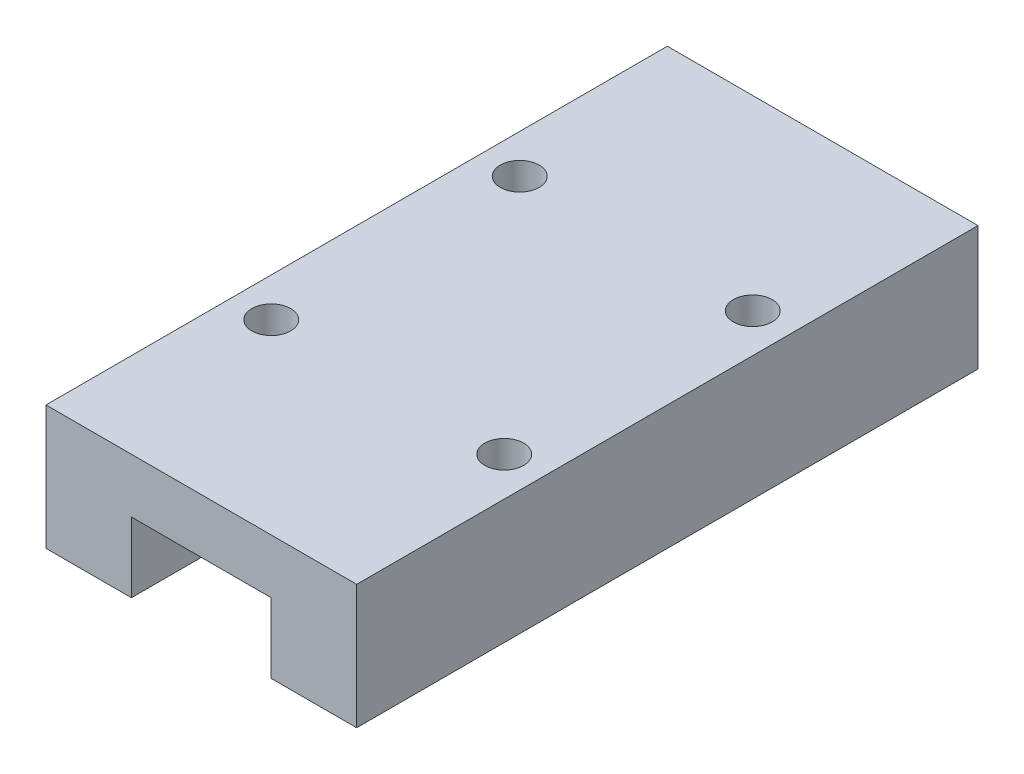
ISO-10303-21;
HEADER;
FILE_DESCRIPTION(('STEP AP214'),'2;1');
FILE_NAME('part.step','',(''),(''),'','','');
FILE_SCHEMA(('AUTOMOTIVE_DESIGN { 1 0 10303 214 1 1 1 1 }'));
ENDSEC;
DATA;
#1=APPLICATION_CONTEXT('core data for automotive mechanical design processes');
#2=APPLICATION_PROTOCOL_DEFINITION('international standard','automotive_design',2000,#1);
#3=PRODUCT_CONTEXT('',#1,'mechanical');
#4=PRODUCT('Part','Part','',(#3));
#5=PRODUCT_RELATED_PRODUCT_CATEGORY('part','',(#4));
#6=PRODUCT_DEFINITION_FORMATION('','',#4);
#7=PRODUCT_DEFINITION_CONTEXT('part definition',#1,'design');
#8=PRODUCT_DEFINITION('design','',#6,#7);
#9=PRODUCT_DEFINITION_SHAPE('','',#8);
#10=(LENGTH_UNIT() NAMED_UNIT(*) SI_UNIT(.MILLI.,.METRE.));
#11=(NAMED_UNIT(*) PLANE_ANGLE_UNIT() SI_UNIT($,.RADIAN.));
#12=(NAMED_UNIT(*) SI_UNIT($,.STERADIAN.) SOLID_ANGLE_UNIT());
#13=UNCERTAINTY_MEASURE_WITH_UNIT(LENGTH_MEASURE(1.E-05),#10,'distance_accuracy_value','');
#14=(GEOMETRIC_REPRESENTATION_CONTEXT(3) GLOBAL_UNCERTAINTY_ASSIGNED_CONTEXT((#13)) GLOBAL_UNIT_ASSIGNED_CONTEXT((#10,
#11,#12)) REPRESENTATION_CONTEXT('',''));
#15=CARTESIAN_POINT('',(0.,0.,0.));
#16=DIRECTION('',(0.,0.,1.));
#17=DIRECTION('',(1.,0.,0.));
#18=AXIS2_PLACEMENT_3D('',#15,#16,#17);
#19=CARTESIAN_POINT('',(5.49999999999995,0.,40.));
#20=DIRECTION('',(0.,1.00000000000001,0.));
#21=DIRECTION('',(-0.999999999999994,0.,0.));
#22=AXIS2_PLACEMENT_3D('',#19,#20,#21);
#23=PLANE('',#22);
#24=DIRECTION('',(0.999999999999994,0.,0.));
#25=VECTOR('',#24,1.);
#26=CARTESIAN_POINT('',(5.49999999999995,0.,0.));
#27=LINE('',#26,#25);
#28=CARTESIAN_POINT('',(0.,0.,0.));
#29=VERTEX_POINT('',#28);
#30=CARTESIAN_POINT('',(5.49999999999995,0.,0.));
#31=VERTEX_POINT('',#30);
#32=EDGE_CURVE('E137',#29,#31,#27,.T.);
#33=ORIENTED_EDGE('',*,*,#32,.T.);
#34=DIRECTION('',(0.,0.,-1.));
#35=VECTOR('',#34,1.);
#36=CARTESIAN_POINT('',(5.49999999999995,0.,40.));
#37=LINE('',#36,#35);
#38=CARTESIAN_POINT('',(5.49999999999995,0.,40.));
#39=VERTEX_POINT('',#38);
#40=EDGE_CURVE('E11',#39,#31,#37,.T.);
#41=ORIENTED_EDGE('',*,*,#40,.F.);
#42=DIRECTION('',(0.999999999999994,0.,0.));
#43=VECTOR('',#42,1.);
#44=CARTESIAN_POINT('',(5.49999999999995,0.,40.));
#45=LINE('',#44,#43);
#46=CARTESIAN_POINT('',(0.,0.,39.9999999999999));
#47=VERTEX_POINT('',#46);
#48=EDGE_CURVE('E152',#47,#39,#45,.T.);
#49=ORIENTED_EDGE('',*,*,#48,.F.);
#50=DIRECTION('',(0.,0.,-1.));
#51=VECTOR('',#50,1.);
#52=CARTESIAN_POINT('',(0.,0.,39.9999999999999));
#53=LINE('',#52,#51);
#54=EDGE_CURVE('E133',#47,#29,#53,.T.);
#55=ORIENTED_EDGE('',*,*,#54,.T.);
#56=EDGE_LOOP('',(#33,#41,#49,#55));
#57=FACE_BOUND('',#56,.T.);
#58=ADVANCED_FACE('F38',(#57),#23,.F.);
#59=CARTESIAN_POINT('',(5.49999999999995,4.50000000000005,40.));
#60=DIRECTION('',(-0.999999999999994,0.,0.));
#61=DIRECTION('',(0.,-1.00000000000001,0.));
#62=AXIS2_PLACEMENT_3D('',#59,#60,#61);
#63=PLANE('',#62);
#64=DIRECTION('',(0.,1.00000000000001,0.));
#65=VECTOR('',#64,1.);
#66=CARTESIAN_POINT('',(5.49999999999995,4.50000000000005,0.));
#67=LINE('',#66,#65);
#68=CARTESIAN_POINT('',(5.49999999999995,4.50000000000005,0.));
#69=VERTEX_POINT('',#68);
#70=EDGE_CURVE('E140',#31,#69,#67,.T.);
#71=ORIENTED_EDGE('',*,*,#70,.T.);
#72=DIRECTION('',(0.,0.,-1.));
#73=VECTOR('',#72,1.);
#74=CARTESIAN_POINT('',(5.49999999999995,4.50000000000005,40.));
#75=LINE('',#74,#73);
#76=CARTESIAN_POINT('',(5.49999999999995,4.50000000000005,40.));
#77=VERTEX_POINT('',#76);
#78=EDGE_CURVE('E46',#77,#69,#75,.T.);
#79=ORIENTED_EDGE('',*,*,#78,.F.);
#80=DIRECTION('',(0.,1.00000000000001,0.));
#81=VECTOR('',#80,1.);
#82=CARTESIAN_POINT('',(5.49999999999995,4.50000000000005,40.));
#83=LINE('',#82,#81);
#84=EDGE_CURVE('E98',#39,#77,#83,.T.);
#85=ORIENTED_EDGE('',*,*,#84,.F.);
#86=ORIENTED_EDGE('',*,*,#40,.T.);
#87=EDGE_LOOP('',(#71,#79,#85,#86));
#88=FACE_BOUND('',#87,.T.);
#89=ADVANCED_FACE('F238',(#88),#63,.F.);
#90=CARTESIAN_POINT('',(14.4999999999999,4.50000000000005,39.9999999999996));
#91=DIRECTION('',(0.,1.00000000000001,0.));
#92=DIRECTION('',(-0.999999999999995,0.,0.));
#93=AXIS2_PLACEMENT_3D('',#90,#91,#92);
#94=PLANE('',#93);
#95=DIRECTION('',(0.999999999999995,0.,0.));
#96=VECTOR('',#95,1.);
#97=CARTESIAN_POINT('',(14.4999999999999,4.50000000000003,-6.38378239159465E-13));
#98=LINE('',#97,#96);
#99=CARTESIAN_POINT('',(14.4999999999999,4.50000000000003,-6.38378239159465E-13));
#100=VERTEX_POINT('',#99);
#101=EDGE_CURVE('E143',#69,#100,#98,.T.);
#102=ORIENTED_EDGE('',*,*,#101,.T.);
#103=DIRECTION('',(0.,0.,-1.));
#104=VECTOR('',#103,1.);
#105=CARTESIAN_POINT('',(14.4999999999999,4.50000000000005,39.9999999999996));
#106=LINE('',#105,#104);
#107=CARTESIAN_POINT('',(14.4999999999999,4.50000000000005,39.9999999999996));
#108=VERTEX_POINT('',#107);
#109=EDGE_CURVE('E159',#108,#100,#106,.T.);
#110=ORIENTED_EDGE('',*,*,#109,.F.);
#111=DIRECTION('',(0.999999999999995,0.,0.));
#112=VECTOR('',#111,1.);
#113=CARTESIAN_POINT('',(14.4999999999999,4.50000000000005,39.9999999999996));
#114=LINE('',#113,#112);
#115=EDGE_CURVE('E167',#77,#108,#114,.T.);
#116=ORIENTED_EDGE('',*,*,#115,.F.);
#117=ORIENTED_EDGE('',*,*,#78,.T.);
#118=EDGE_LOOP('',(#102,#110,#116,#117));
#119=FACE_BOUND('',#118,.T.);
#120=ADVANCED_FACE('F165',(#119),#94,.F.);
#121=CARTESIAN_POINT('',(14.4999999999999,0.,39.9999999999996));
#122=DIRECTION('',(0.999999999999994,0.,0.));
#123=DIRECTION('',(0.,0.,-1.));
#124=AXIS2_PLACEMENT_3D('',#121,#122,#123);
#125=PLANE('',#124);
#126=DIRECTION('',(0.,-1.00000000000001,0.));
#127=VECTOR('',#126,1.);
#128=CARTESIAN_POINT('',(14.4999999999999,0.,-6.38378239159465E-13));
#129=LINE('',#128,#127);
#130=CARTESIAN_POINT('',(14.4999999999999,0.,-6.38378239159465E-13));
#131=VERTEX_POINT('',#130);
#132=EDGE_CURVE('E145',#100,#131,#129,.T.);
#133=ORIENTED_EDGE('',*,*,#132,.T.);
#134=DIRECTION('',(0.,0.,-1.));
#135=VECTOR('',#134,1.);
#136=CARTESIAN_POINT('',(14.4999999999999,0.,39.9999999999996));
#137=LINE('',#136,#135);
#138=CARTESIAN_POINT('',(14.4999999999999,0.,39.9999999999996));
#139=VERTEX_POINT('',#138);
#140=EDGE_CURVE('E156',#139,#131,#137,.T.);
#141=ORIENTED_EDGE('',*,*,#140,.F.);
#142=DIRECTION('',(0.,-1.00000000000001,0.));
#143=VECTOR('',#142,1.);
#144=CARTESIAN_POINT('',(14.4999999999999,0.,39.9999999999996));
#145=LINE('',#144,#143);
#146=EDGE_CURVE('E179',#108,#139,#145,.T.);
#147=ORIENTED_EDGE('',*,*,#146,.F.);
#148=ORIENTED_EDGE('',*,*,#109,.T.);
#149=EDGE_LOOP('',(#133,#141,#147,#148));
#150=FACE_BOUND('',#149,.T.);
#151=ADVANCED_FACE('F175',(#150),#125,.F.);
#152=CARTESIAN_POINT('',(19.9999999999998,0.,39.9999999999999));
#153=DIRECTION('',(0.,1.00000000000001,0.));
#154=DIRECTION('',(-0.999999999999994,0.,0.));
#155=AXIS2_PLACEMENT_3D('',#152,#153,#154);
#156=PLANE('',#155);
#157=DIRECTION('',(0.999999999999994,0.,0.));
#158=VECTOR('',#157,1.);
#159=CARTESIAN_POINT('',(19.9999999999998,0.,-1.11022302462516E-13));
#160=LINE('',#159,#158);
#161=CARTESIAN_POINT('',(19.9999999999998,0.,-1.11022302462516E-13));
#162=VERTEX_POINT('',#161);
#163=EDGE_CURVE('E147',#131,#162,#160,.T.);
#164=ORIENTED_EDGE('',*,*,#163,.T.);
#165=DIRECTION('',(0.,0.,-1.));
#166=VECTOR('',#165,1.);
#167=CARTESIAN_POINT('',(19.9999999999998,0.,39.9999999999999));
#168=LINE('',#167,#166);
#169=CARTESIAN_POINT('',(19.9999999999998,0.,39.9999999999999));
#170=VERTEX_POINT('',#169);
#171=EDGE_CURVE('E128',#170,#162,#168,.T.);
#172=ORIENTED_EDGE('',*,*,#171,.F.);
#173=DIRECTION('',(0.999999999999994,0.,0.));
#174=VECTOR('',#173,1.);
#175=CARTESIAN_POINT('',(19.9999999999998,0.,39.9999999999999));
#176=LINE('',#175,#174);
#177=EDGE_CURVE('E119',#139,#170,#176,.T.);
#178=ORIENTED_EDGE('',*,*,#177,.F.);
#179=ORIENTED_EDGE('',*,*,#140,.T.);
#180=EDGE_LOOP('',(#164,#172,#178,#179));
#181=FACE_BOUND('',#180,.T.);
#182=ADVANCED_FACE('F178',(#181),#156,.F.);
#183=CARTESIAN_POINT('',(19.9999999999998,8.00000000000009,39.9999999999999));
#184=DIRECTION('',(-0.999999999999994,0.,0.));
#185=DIRECTION('',(0.,-1.00000000000001,0.));
#186=AXIS2_PLACEMENT_3D('',#183,#184,#185);
#187=PLANE('',#186);
#188=DIRECTION('',(0.,1.00000000000001,0.));
#189=VECTOR('',#188,1.);
#190=CARTESIAN_POINT('',(19.9999999999998,8.00000000000009,-1.11022302462516E-13));
#191=LINE('',#190,#189);
#192=CARTESIAN_POINT('',(19.9999999999998,8.00000000000009,-1.11022302462516E-13));
#193=VERTEX_POINT('',#192);
#194=EDGE_CURVE('E127',#162,#193,#191,.T.);
#195=ORIENTED_EDGE('',*,*,#194,.T.);
#196=DIRECTION('',(0.,0.,-1.));
#197=VECTOR('',#196,1.);
#198=CARTESIAN_POINT('',(19.9999999999998,8.00000000000009,39.9999999999999));
#199=LINE('',#198,#197);
#200=CARTESIAN_POINT('',(19.9999999999998,8.00000000000009,39.9999999999999));
#201=VERTEX_POINT('',#200);
#202=EDGE_CURVE('E124',#201,#193,#199,.T.);
#203=ORIENTED_EDGE('',*,*,#202,.F.);
#204=DIRECTION('',(0.,1.00000000000001,0.));
#205=VECTOR('',#204,1.);
#206=CARTESIAN_POINT('',(19.9999999999998,8.00000000000009,39.9999999999999));
#207=LINE('',#206,#205);
#208=EDGE_CURVE('E113',#170,#201,#207,.T.);
#209=ORIENTED_EDGE('',*,*,#208,.F.);
#210=ORIENTED_EDGE('',*,*,#171,.T.);
#211=EDGE_LOOP('',(#195,#203,#209,#210));
#212=FACE_BOUND('',#211,.T.);
#213=ADVANCED_FACE('F125',(#212),#187,.F.);
#214=CARTESIAN_POINT('',(0.,8.00000000000008,39.9999999999999));
#215=DIRECTION('',(0.,-1.00000000000001,0.));
#216=DIRECTION('',(0.999999999999994,0.,0.));
#217=AXIS2_PLACEMENT_3D('',#214,#215,#216);
#218=PLANE('',#217);
#219=CARTESIAN_POINT('',(2.49999999999997,8.00000000000009,12.));
#220=DIRECTION('',(0.,1.00000000000001,0.));
#221=DIRECTION('',(0.,0.,1.));
#222=AXIS2_PLACEMENT_3D('',#219,#220,#221);
#223=CIRCLE('',#222,1.24999999999999);
#224=CARTESIAN_POINT('',(2.49999999999997,8.00000000000009,13.2499999999999));
#225=VERTEX_POINT('',#224);
#226=EDGE_CURVE('E205',#225,#225,#223,.T.);
#227=ORIENTED_EDGE('',*,*,#226,.F.);
#228=EDGE_LOOP('',(#227));
#229=FACE_BOUND('',#228,.T.);
#230=CARTESIAN_POINT('',(17.4999999999998,8.00000000000009,27.9999999999999));
#231=DIRECTION('',(0.,1.00000000000001,0.));
#232=DIRECTION('',(0.,0.,1.));
#233=AXIS2_PLACEMENT_3D('',#230,#231,#232);
#234=CIRCLE('',#233,1.24999999999999);
#235=CARTESIAN_POINT('',(17.4999999999998,8.00000000000009,29.2499999999998));
#236=VERTEX_POINT('',#235);
#237=EDGE_CURVE('E199',#236,#236,#234,.T.);
#238=ORIENTED_EDGE('',*,*,#237,.F.);
#239=EDGE_LOOP('',(#238));
#240=FACE_BOUND('',#239,.T.);
#241=CARTESIAN_POINT('',(17.4999999999998,8.0000000000001,11.9999999999998));
#242=DIRECTION('',(0.,1.00000000000001,0.));
#243=DIRECTION('',(0.,0.,1.));
#244=AXIS2_PLACEMENT_3D('',#241,#242,#243);
#245=CIRCLE('',#244,1.24999999999999);
#246=CARTESIAN_POINT('',(17.4999999999998,8.0000000000001,13.2499999999998));
#247=VERTEX_POINT('',#246);
#248=EDGE_CURVE('E193',#247,#247,#245,.T.);
#249=ORIENTED_EDGE('',*,*,#248,.F.);
#250=EDGE_LOOP('',(#249));
#251=FACE_BOUND('',#250,.T.);
#252=CARTESIAN_POINT('',(2.49999999999997,8.00000000000006,28.));
#253=DIRECTION('',(0.,1.00000000000001,0.));
#254=DIRECTION('',(0.,0.,1.));
#255=AXIS2_PLACEMENT_3D('',#252,#253,#254);
#256=CIRCLE('',#255,1.24999999999999);
#257=CARTESIAN_POINT('',(2.49999999999997,8.00000000000006,29.25));
#258=VERTEX_POINT('',#257);
#259=EDGE_CURVE('E187',#258,#258,#256,.T.);
#260=ORIENTED_EDGE('',*,*,#259,.F.);
#261=EDGE_LOOP('',(#260));
#262=FACE_BOUND('',#261,.T.);
#263=DIRECTION('',(-0.999999999999994,0.,0.));
#264=VECTOR('',#263,1.);
#265=CARTESIAN_POINT('',(0.,8.00000000000009,0.));
#266=LINE('',#265,#264);
#267=CARTESIAN_POINT('',(0.,8.00000000000009,0.));
#268=VERTEX_POINT('',#267);
#269=EDGE_CURVE('E84',#193,#268,#266,.T.);
#270=ORIENTED_EDGE('',*,*,#269,.T.);
#271=DIRECTION('',(0.,0.,-1.));
#272=VECTOR('',#271,1.);
#273=CARTESIAN_POINT('',(0.,8.00000000000008,39.9999999999999));
#274=LINE('',#273,#272);
#275=CARTESIAN_POINT('',(0.,8.00000000000008,39.9999999999999));
#276=VERTEX_POINT('',#275);
#277=EDGE_CURVE('E129',#276,#268,#274,.T.);
#278=ORIENTED_EDGE('',*,*,#277,.F.);
#279=DIRECTION('',(-0.999999999999994,0.,0.));
#280=VECTOR('',#279,1.);
#281=CARTESIAN_POINT('',(0.,8.00000000000008,39.9999999999999));
#282=LINE('',#281,#280);
#283=EDGE_CURVE('E117',#201,#276,#282,.T.);
#284=ORIENTED_EDGE('',*,*,#283,.F.);
#285=ORIENTED_EDGE('',*,*,#202,.T.);
#286=EDGE_LOOP('',(#270,#278,#284,#285));
#287=FACE_BOUND('',#286,.T.);
#288=ADVANCED_FACE('F131',(#229,#240,#251,#262,#287),#218,.F.);
#289=CARTESIAN_POINT('',(0.,0.,39.9999999999999));
#290=DIRECTION('',(0.999999999999994,0.,0.));
#291=DIRECTION('',(0.,0.,-1.));
#292=AXIS2_PLACEMENT_3D('',#289,#290,#291);
#293=PLANE('',#292);
#294=DIRECTION('',(0.,-1.00000000000001,0.));
#295=VECTOR('',#294,1.);
#296=CARTESIAN_POINT('',(0.,0.,0.));
#297=LINE('',#296,#295);
#298=EDGE_CURVE('E90',#268,#29,#297,.T.);
#299=ORIENTED_EDGE('',*,*,#298,.T.);
#300=ORIENTED_EDGE('',*,*,#54,.F.);
#301=DIRECTION('',(0.,-1.00000000000001,0.));
#302=VECTOR('',#301,1.);
#303=CARTESIAN_POINT('',(0.,0.,39.9999999999999));
#304=LINE('',#303,#302);
#305=EDGE_CURVE('E54',#276,#47,#304,.T.);
#306=ORIENTED_EDGE('',*,*,#305,.F.);
#307=ORIENTED_EDGE('',*,*,#277,.T.);
#308=EDGE_LOOP('',(#299,#300,#306,#307));
#309=FACE_BOUND('',#308,.T.);
#310=ADVANCED_FACE('F213',(#309),#293,.F.);
#311=CARTESIAN_POINT('',(0.,0.,39.9999999999999));
#312=DIRECTION('',(0.,0.,-1.));
#313=DIRECTION('',(-0.999999999999994,0.,0.));
#314=AXIS2_PLACEMENT_3D('',#311,#312,#313);
#315=PLANE('',#314);
#316=ORIENTED_EDGE('',*,*,#48,.T.);
#317=ORIENTED_EDGE('',*,*,#84,.T.);
#318=ORIENTED_EDGE('',*,*,#115,.T.);
#319=ORIENTED_EDGE('',*,*,#146,.T.);
#320=ORIENTED_EDGE('',*,*,#177,.T.);
#321=ORIENTED_EDGE('',*,*,#208,.T.);
#322=ORIENTED_EDGE('',*,*,#283,.T.);
#323=ORIENTED_EDGE('',*,*,#305,.T.);
#324=EDGE_LOOP('',(#316,#317,#318,#319,#320,#321,#322,#323));
#325=FACE_BOUND('',#324,.T.);
#326=ADVANCED_FACE('F115',(#325),#315,.F.);
#327=CARTESIAN_POINT('',(0.,0.,0.));
#328=DIRECTION('',(0.,0.,-1.));
#329=DIRECTION('',(-0.999999999999994,0.,0.));
#330=AXIS2_PLACEMENT_3D('',#327,#328,#329);
#331=PLANE('',#330);
#332=ORIENTED_EDGE('',*,*,#32,.F.);
#333=ORIENTED_EDGE('',*,*,#298,.F.);
#334=ORIENTED_EDGE('',*,*,#269,.F.);
#335=ORIENTED_EDGE('',*,*,#194,.F.);
#336=ORIENTED_EDGE('',*,*,#163,.F.);
#337=ORIENTED_EDGE('',*,*,#132,.F.);
#338=ORIENTED_EDGE('',*,*,#101,.F.);
#339=ORIENTED_EDGE('',*,*,#70,.F.);
#340=EDGE_LOOP('',(#332,#333,#334,#335,#336,#337,#338,#339));
#341=FACE_BOUND('',#340,.T.);
#342=ADVANCED_FACE('F171',(#341),#331,.T.);
#343=CARTESIAN_POINT('',(2.49999999999998,2.00000000000001,28.));
#344=DIRECTION('',(0.,1.00000000000001,0.));
#345=DIRECTION('',(0.,0.,1.));
#346=AXIS2_PLACEMENT_3D('',#343,#344,#345);
#347=CONICAL_SURFACE('',#346,1.25,1.02974425867665);
#348=CARTESIAN_POINT('',(2.49999999999997,1.24892422621556,28.));
#349=VERTEX_POINT('',#348);
#350=VERTEX_LOOP('',#349);
#351=FACE_BOUND('',#350,.T.);
#352=CARTESIAN_POINT('',(2.49999999999998,2.00000000000001,28.));
#353=DIRECTION('',(0.,1.00000000000001,0.));
#354=DIRECTION('',(0.,0.,1.));
#355=AXIS2_PLACEMENT_3D('',#352,#353,#354);
#356=CIRCLE('',#355,1.25);
#357=CARTESIAN_POINT('',(2.49999999999998,2.00000000000001,29.25));
#358=VERTEX_POINT('',#357);
#359=EDGE_CURVE('E141',#358,#358,#356,.T.);
#360=ORIENTED_EDGE('',*,*,#359,.T.);
#361=EDGE_LOOP('',(#360));
#362=FACE_BOUND('',#361,.T.);
#363=ADVANCED_FACE('F224',(#351,#362),#347,.F.);
#364=CARTESIAN_POINT('',(2.49999999999997,8.00000000000006,28.));
#365=DIRECTION('',(0.,1.00000000000001,0.));
#366=DIRECTION('',(0.,0.,1.));
#367=AXIS2_PLACEMENT_3D('',#364,#365,#366);
#368=CYLINDRICAL_SURFACE('',#367,1.24999999999999);
#369=ORIENTED_EDGE('',*,*,#359,.F.);
#370=EDGE_LOOP('',(#369));
#371=FACE_BOUND('',#370,.T.);
#372=ORIENTED_EDGE('',*,*,#259,.T.);
#373=EDGE_LOOP('',(#372));
#374=FACE_BOUND('',#373,.T.);
#375=ADVANCED_FACE('F221',(#371,#374),#368,.F.);
#376=CARTESIAN_POINT('',(17.4999999999998,2.00000000000002,11.9999999999999));
#377=DIRECTION('',(0.,1.00000000000001,0.));
#378=DIRECTION('',(0.,0.,1.));
#379=AXIS2_PLACEMENT_3D('',#376,#377,#378);
#380=CONICAL_SURFACE('',#379,1.25,1.02974425867665);
#381=CARTESIAN_POINT('',(17.4999999999998,1.24892422621556,11.9999999999999));
#382=VERTEX_POINT('',#381);
#383=VERTEX_LOOP('',#382);
#384=FACE_BOUND('',#383,.T.);
#385=CARTESIAN_POINT('',(17.4999999999998,2.00000000000002,11.9999999999999));
#386=DIRECTION('',(0.,1.00000000000001,0.));
#387=DIRECTION('',(0.,0.,1.));
#388=AXIS2_PLACEMENT_3D('',#385,#386,#387);
#389=CIRCLE('',#388,1.25);
#390=CARTESIAN_POINT('',(17.4999999999998,2.00000000000002,13.2499999999999));
#391=VERTEX_POINT('',#390);
#392=EDGE_CURVE('E190',#391,#391,#389,.T.);
#393=ORIENTED_EDGE('',*,*,#392,.T.);
#394=EDGE_LOOP('',(#393));
#395=FACE_BOUND('',#394,.T.);
#396=ADVANCED_FACE('F223',(#384,#395),#380,.F.);
#397=CARTESIAN_POINT('',(17.4999999999998,8.0000000000001,11.9999999999998));
#398=DIRECTION('',(0.,1.00000000000001,0.));
#399=DIRECTION('',(0.,0.,1.));
#400=AXIS2_PLACEMENT_3D('',#397,#398,#399);
#401=CYLINDRICAL_SURFACE('',#400,1.24999999999999);
#402=ORIENTED_EDGE('',*,*,#392,.F.);
#403=EDGE_LOOP('',(#402));
#404=FACE_BOUND('',#403,.T.);
#405=ORIENTED_EDGE('',*,*,#248,.T.);
#406=EDGE_LOOP('',(#405));
#407=FACE_BOUND('',#406,.T.);
#408=ADVANCED_FACE('F231',(#404,#407),#401,.F.);
#409=CARTESIAN_POINT('',(17.4999999999999,2.00000000000002,27.9999999999999));
#410=DIRECTION('',(0.,1.00000000000001,0.));
#411=DIRECTION('',(0.,0.,1.));
#412=AXIS2_PLACEMENT_3D('',#409,#410,#411);
#413=CONICAL_SURFACE('',#412,1.25,1.02974425867665);
#414=CARTESIAN_POINT('',(17.4999999999999,1.24892422621556,27.9999999999999));
#415=VERTEX_POINT('',#414);
#416=VERTEX_LOOP('',#415);
#417=FACE_BOUND('',#416,.T.);
#418=CARTESIAN_POINT('',(17.4999999999999,2.00000000000002,27.9999999999999));
#419=DIRECTION('',(0.,1.00000000000001,0.));
#420=DIRECTION('',(0.,0.,1.));
#421=AXIS2_PLACEMENT_3D('',#418,#419,#420);
#422=CIRCLE('',#421,1.25);
#423=CARTESIAN_POINT('',(17.4999999999999,2.00000000000002,29.2499999999999));
#424=VERTEX_POINT('',#423);
#425=EDGE_CURVE('E196',#424,#424,#422,.T.);
#426=ORIENTED_EDGE('',*,*,#425,.T.);
#427=EDGE_LOOP('',(#426));
#428=FACE_BOUND('',#427,.T.);
#429=ADVANCED_FACE('F324',(#417,#428),#413,.F.);
#430=CARTESIAN_POINT('',(17.4999999999998,8.00000000000009,27.9999999999999));
#431=DIRECTION('',(0.,1.00000000000001,0.));
#432=DIRECTION('',(0.,0.,1.));
#433=AXIS2_PLACEMENT_3D('',#430,#431,#432);
#434=CYLINDRICAL_SURFACE('',#433,1.24999999999999);
#435=ORIENTED_EDGE('',*,*,#425,.F.);
#436=EDGE_LOOP('',(#435));
#437=FACE_BOUND('',#436,.T.);
#438=ORIENTED_EDGE('',*,*,#237,.T.);
#439=EDGE_LOOP('',(#438));
#440=FACE_BOUND('',#439,.T.);
#441=ADVANCED_FACE('F335',(#437,#440),#434,.F.);
#442=CARTESIAN_POINT('',(2.49999999999998,2.00000000000002,12.));
#443=DIRECTION('',(0.,1.00000000000001,0.));
#444=DIRECTION('',(0.,0.,1.));
#445=AXIS2_PLACEMENT_3D('',#442,#443,#444);
#446=CONICAL_SURFACE('',#445,1.25,1.02974425867665);
#447=CARTESIAN_POINT('',(2.49999999999997,1.24892422621555,12.));
#448=VERTEX_POINT('',#447);
#449=VERTEX_LOOP('',#448);
#450=FACE_BOUND('',#449,.T.);
#451=CARTESIAN_POINT('',(2.49999999999998,2.00000000000002,12.));
#452=DIRECTION('',(0.,1.00000000000001,0.));
#453=DIRECTION('',(0.,0.,1.));
#454=AXIS2_PLACEMENT_3D('',#451,#452,#453);
#455=CIRCLE('',#454,1.25);
#456=CARTESIAN_POINT('',(2.49999999999998,2.00000000000002,13.25));
#457=VERTEX_POINT('',#456);
#458=EDGE_CURVE('E202',#457,#457,#455,.T.);
#459=ORIENTED_EDGE('',*,*,#458,.T.);
#460=EDGE_LOOP('',(#459));
#461=FACE_BOUND('',#460,.T.);
#462=ADVANCED_FACE('F345',(#450,#461),#446,.F.);
#463=CARTESIAN_POINT('',(2.49999999999997,8.00000000000009,12.));
#464=DIRECTION('',(0.,1.00000000000001,0.));
#465=DIRECTION('',(0.,0.,1.));
#466=AXIS2_PLACEMENT_3D('',#463,#464,#465);
#467=CYLINDRICAL_SURFACE('',#466,1.24999999999999);
#468=ORIENTED_EDGE('',*,*,#458,.F.);
#469=EDGE_LOOP('',(#468));
#470=FACE_BOUND('',#469,.T.);
#471=ORIENTED_EDGE('',*,*,#226,.T.);
#472=EDGE_LOOP('',(#471));
#473=FACE_BOUND('',#472,.T.);
#474=ADVANCED_FACE('F209',(#470,#473),#467,.F.);
#475=CLOSED_SHELL('',(#58,#89,#120,#151,#182,#213,#288,#310,#326,#342,#363,#375,#396,#408,#429,
#441,#462,#474));
#476=MANIFOLD_SOLID_BREP('B2',#475);
#477=ADVANCED_BREP_SHAPE_REPRESENTATION('',(#18,#476),#14);
#478=SHAPE_DEFINITION_REPRESENTATION(#9,#477);
ENDSEC;
END-ISO-10303-21;
